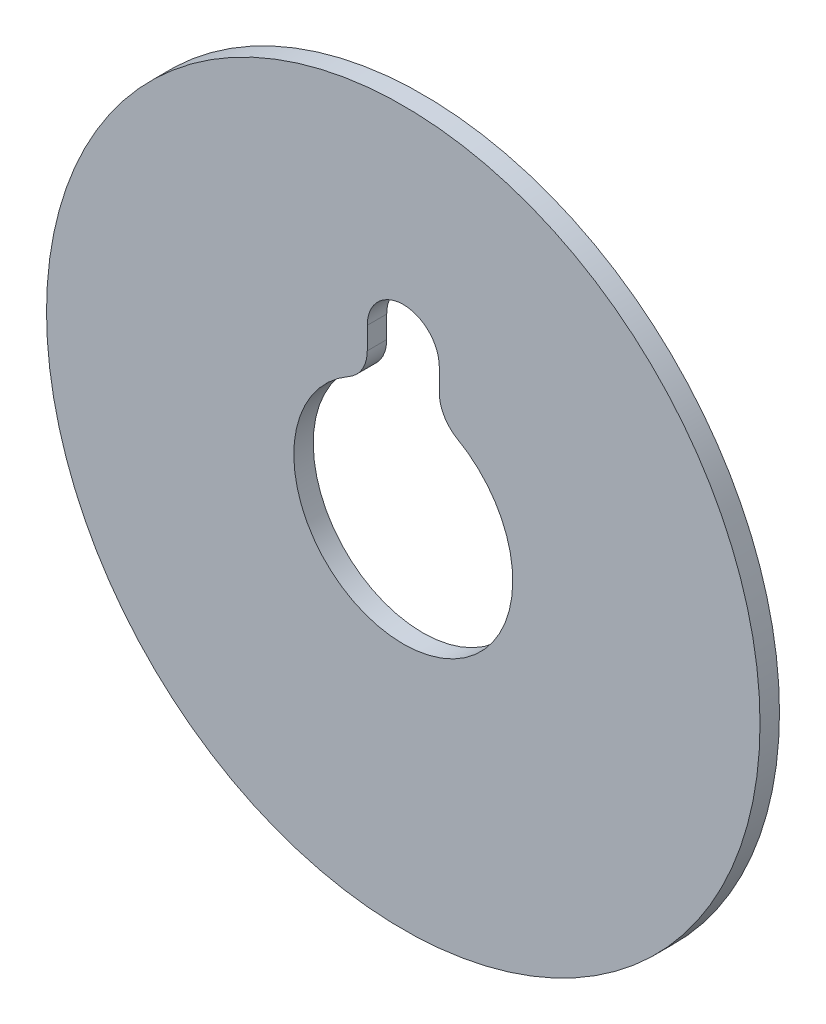
ISO-10303-21;
HEADER;
FILE_DESCRIPTION(('STEP AP214'),'2;1');
FILE_NAME('part.step','',(''),(''),'','','');
FILE_SCHEMA(('AUTOMOTIVE_DESIGN { 1 0 10303 214 1 1 1 1 }'));
ENDSEC;
DATA;
#1=APPLICATION_CONTEXT('core data for automotive mechanical design processes');
#2=APPLICATION_PROTOCOL_DEFINITION('international standard','automotive_design',2000,#1);
#3=PRODUCT_CONTEXT('',#1,'mechanical');
#4=PRODUCT('Part','Part','',(#3));
#5=PRODUCT_RELATED_PRODUCT_CATEGORY('part','',(#4));
#6=PRODUCT_DEFINITION_FORMATION('','',#4);
#7=PRODUCT_DEFINITION_CONTEXT('part definition',#1,'design');
#8=PRODUCT_DEFINITION('design','',#6,#7);
#9=PRODUCT_DEFINITION_SHAPE('','',#8);
#10=(LENGTH_UNIT() NAMED_UNIT(*) SI_UNIT(.MILLI.,.METRE.));
#11=(NAMED_UNIT(*) PLANE_ANGLE_UNIT() SI_UNIT($,.RADIAN.));
#12=(NAMED_UNIT(*) SI_UNIT($,.STERADIAN.) SOLID_ANGLE_UNIT());
#13=UNCERTAINTY_MEASURE_WITH_UNIT(LENGTH_MEASURE(1.E-05),#10,'distance_accuracy_value','');
#14=(GEOMETRIC_REPRESENTATION_CONTEXT(3) GLOBAL_UNCERTAINTY_ASSIGNED_CONTEXT((#13)) GLOBAL_UNIT_ASSIGNED_CONTEXT((#10,
#11,#12)) REPRESENTATION_CONTEXT('',''));
#15=CARTESIAN_POINT('',(0.,0.,0.));
#16=DIRECTION('',(0.,0.,1.));
#17=DIRECTION('',(1.,0.,0.));
#18=AXIS2_PLACEMENT_3D('',#15,#16,#17);
#19=CARTESIAN_POINT('',(0.,0.,3.429));
#20=DIRECTION('',(0.,0.,-1.));
#21=DIRECTION('',(-1.,0.,0.));
#22=AXIS2_PLACEMENT_3D('',#19,#20,#21);
#23=PLANE('',#22);
#24=DIRECTION('',(0.,1.,0.));
#25=VECTOR('',#24,1.);
#26=CARTESIAN_POINT('',(-6.35,22.2898567963109,3.429));
#27=LINE('',#26,#25);
#28=CARTESIAN_POINT('',(-6.35,22.2898567963104,3.429));
#29=VERTEX_POINT('',#28);
#30=CARTESIAN_POINT('',(-6.35,26.19248,3.429));
#31=VERTEX_POINT('',#30);
#32=EDGE_CURVE('E73',#29,#31,#27,.T.);
#33=ORIENTED_EDGE('',*,*,#32,.T.);
#34=CARTESIAN_POINT('',(0.,26.19248,3.429));
#35=DIRECTION('',(0.,0.,1.));
#36=DIRECTION('',(1.,0.,0.));
#37=AXIS2_PLACEMENT_3D('',#34,#35,#36);
#38=CIRCLE('',#37,6.35);
#39=CARTESIAN_POINT('',(6.35,26.19248,3.429));
#40=VERTEX_POINT('',#39);
#41=EDGE_CURVE('E109',#31,#40,#38,.F.);
#42=ORIENTED_EDGE('',*,*,#41,.T.);
#43=DIRECTION('',(0.,1.,0.));
#44=VECTOR('',#43,1.);
#45=CARTESIAN_POINT('',(6.35,26.19248,3.429));
#46=LINE('',#45,#44);
#47=CARTESIAN_POINT('',(6.35,22.2898567963104,3.429));
#48=VERTEX_POINT('',#47);
#49=EDGE_CURVE('E94',#40,#48,#46,.F.);
#50=ORIENTED_EDGE('',*,*,#49,.T.);
#51=CARTESIAN_POINT('',(12.7,22.2898567963098,3.429));
#52=DIRECTION('',(0.,0.,1.));
#53=DIRECTION('',(1.,0.,0.));
#54=AXIS2_PLACEMENT_3D('',#51,#52,#53);
#55=CIRCLE('',#54,6.35);
#56=CARTESIAN_POINT('',(9.5564356435642,16.7725655100946,3.429));
#57=VERTEX_POINT('',#56);
#58=EDGE_CURVE('E111',#57,#48,#55,.F.);
#59=ORIENTED_EDGE('',*,*,#58,.F.);
#60=CARTESIAN_POINT('',(0.,0.,3.429));
#61=DIRECTION('',(0.,0.,1.));
#62=DIRECTION('',(1.,0.,0.));
#63=AXIS2_PLACEMENT_3D('',#60,#61,#62);
#64=CIRCLE('',#63,19.304);
#65=CARTESIAN_POINT('',(-9.5564356435642,16.7725655100946,3.429));
#66=VERTEX_POINT('',#65);
#67=EDGE_CURVE('E75',#57,#66,#64,.F.);
#68=ORIENTED_EDGE('',*,*,#67,.T.);
#69=CARTESIAN_POINT('',(-12.7,22.2898567963098,3.429));
#70=DIRECTION('',(0.,0.,1.));
#71=DIRECTION('',(1.,0.,0.));
#72=AXIS2_PLACEMENT_3D('',#69,#70,#71);
#73=CIRCLE('',#72,6.35);
#74=EDGE_CURVE('E68',#29,#66,#73,.F.);
#75=ORIENTED_EDGE('',*,*,#74,.F.);
#76=EDGE_LOOP('',(#33,#42,#50,#59,#68,#75));
#77=FACE_BOUND('',#76,.T.);
#78=CARTESIAN_POINT('',(0.,0.,3.429));
#79=DIRECTION('',(0.,0.,1.));
#80=DIRECTION('',(1.,0.,0.));
#81=AXIS2_PLACEMENT_3D('',#78,#79,#80);
#82=CIRCLE('',#81,62.90437);
#83=CARTESIAN_POINT('',(62.90437,0.,3.429));
#84=VERTEX_POINT('',#83);
#85=EDGE_CURVE('E20',#84,#84,#82,.F.);
#86=ORIENTED_EDGE('',*,*,#85,.F.);
#87=EDGE_LOOP('',(#86));
#88=FACE_BOUND('',#87,.T.);
#89=ADVANCED_FACE('F17',(#77,#88),#23,.F.);
#90=CARTESIAN_POINT('',(0.,0.,0.));
#91=DIRECTION('',(0.,0.,1.));
#92=DIRECTION('',(1.,0.,0.));
#93=AXIS2_PLACEMENT_3D('',#90,#91,#92);
#94=CYLINDRICAL_SURFACE('',#93,62.90437);
#95=CARTESIAN_POINT('',(0.,0.,0.));
#96=DIRECTION('',(0.,0.,1.));
#97=DIRECTION('',(1.,0.,0.));
#98=AXIS2_PLACEMENT_3D('',#95,#96,#97);
#99=CIRCLE('',#98,62.90437);
#100=CARTESIAN_POINT('',(62.90437,0.,0.));
#101=VERTEX_POINT('',#100);
#102=EDGE_CURVE('E87',#101,#101,#99,.F.);
#103=ORIENTED_EDGE('',*,*,#102,.F.);
#104=EDGE_LOOP('',(#103));
#105=FACE_BOUND('',#104,.T.);
#106=ORIENTED_EDGE('',*,*,#85,.T.);
#107=EDGE_LOOP('',(#106));
#108=FACE_BOUND('',#107,.T.);
#109=ADVANCED_FACE('F188',(#105,#108),#94,.T.);
#110=CARTESIAN_POINT('',(-12.7,22.2898567963098,0.));
#111=DIRECTION('',(0.,0.,1.));
#112=DIRECTION('',(1.,0.,0.));
#113=AXIS2_PLACEMENT_3D('',#110,#111,#112);
#114=CYLINDRICAL_SURFACE('',#113,6.35);
#115=CARTESIAN_POINT('',(-12.7,22.2898567963098,0.));
#116=DIRECTION('',(0.,0.,1.));
#117=DIRECTION('',(1.,0.,0.));
#118=AXIS2_PLACEMENT_3D('',#115,#116,#117);
#119=CIRCLE('',#118,6.35);
#120=CARTESIAN_POINT('',(-6.35,22.2898567963104,0.));
#121=VERTEX_POINT('',#120);
#122=CARTESIAN_POINT('',(-9.5564356435642,16.7725655100946,0.));
#123=VERTEX_POINT('',#122);
#124=EDGE_CURVE('E83',#121,#123,#119,.F.);
#125=ORIENTED_EDGE('',*,*,#124,.F.);
#126=DIRECTION('',(0.,0.,1.));
#127=VECTOR('',#126,1.);
#128=CARTESIAN_POINT('',(-6.35,22.2898567963109,0.));
#129=LINE('',#128,#127);
#130=EDGE_CURVE('E80',#121,#29,#129,.T.);
#131=ORIENTED_EDGE('',*,*,#130,.T.);
#132=ORIENTED_EDGE('',*,*,#74,.T.);
#133=DIRECTION('',(0.,0.,1.));
#134=VECTOR('',#133,1.);
#135=CARTESIAN_POINT('',(-9.55643564356404,16.7725655100947,0.));
#136=LINE('',#135,#134);
#137=EDGE_CURVE('E78',#66,#123,#136,.F.);
#138=ORIENTED_EDGE('',*,*,#137,.T.);
#139=EDGE_LOOP('',(#125,#131,#132,#138));
#140=FACE_BOUND('',#139,.T.);
#141=ADVANCED_FACE('F81',(#140),#114,.T.);
#142=CARTESIAN_POINT('',(0.,0.,0.));
#143=DIRECTION('',(0.,0.,1.));
#144=DIRECTION('',(1.,0.,0.));
#145=AXIS2_PLACEMENT_3D('',#142,#143,#144);
#146=CYLINDRICAL_SURFACE('',#145,19.304);
#147=DIRECTION('',(0.,0.,1.));
#148=VECTOR('',#147,1.);
#149=CARTESIAN_POINT('',(9.55643564356405,16.7725655100947,0.));
#150=LINE('',#149,#148);
#151=CARTESIAN_POINT('',(9.5564356435642,16.7725655100946,0.));
#152=VERTEX_POINT('',#151);
#153=EDGE_CURVE('E113',#152,#57,#150,.T.);
#154=ORIENTED_EDGE('',*,*,#153,.F.);
#155=CARTESIAN_POINT('',(0.,0.,0.));
#156=DIRECTION('',(0.,0.,1.));
#157=DIRECTION('',(1.,0.,0.));
#158=AXIS2_PLACEMENT_3D('',#155,#156,#157);
#159=CIRCLE('',#158,19.304);
#160=EDGE_CURVE('E105',#123,#152,#159,.T.);
#161=ORIENTED_EDGE('',*,*,#160,.F.);
#162=ORIENTED_EDGE('',*,*,#137,.F.);
#163=ORIENTED_EDGE('',*,*,#67,.F.);
#164=EDGE_LOOP('',(#154,#161,#162,#163));
#165=FACE_BOUND('',#164,.T.);
#166=ADVANCED_FACE('F116',(#165),#146,.F.);
#167=CARTESIAN_POINT('',(12.7,22.2898567963098,0.));
#168=DIRECTION('',(0.,0.,1.));
#169=DIRECTION('',(1.,0.,0.));
#170=AXIS2_PLACEMENT_3D('',#167,#168,#169);
#171=CYLINDRICAL_SURFACE('',#170,6.35);
#172=CARTESIAN_POINT('',(12.7,22.2898567963098,0.));
#173=DIRECTION('',(0.,0.,1.));
#174=DIRECTION('',(1.,0.,0.));
#175=AXIS2_PLACEMENT_3D('',#172,#173,#174);
#176=CIRCLE('',#175,6.35);
#177=CARTESIAN_POINT('',(6.35,22.2898567963104,0.));
#178=VERTEX_POINT('',#177);
#179=EDGE_CURVE('E102',#152,#178,#176,.F.);
#180=ORIENTED_EDGE('',*,*,#179,.F.);
#181=ORIENTED_EDGE('',*,*,#153,.T.);
#182=ORIENTED_EDGE('',*,*,#58,.T.);
#183=DIRECTION('',(0.,0.,-1.));
#184=VECTOR('',#183,1.);
#185=CARTESIAN_POINT('',(6.35,22.2898567963109,0.));
#186=LINE('',#185,#184);
#187=EDGE_CURVE('E98',#48,#178,#186,.T.);
#188=ORIENTED_EDGE('',*,*,#187,.T.);
#189=EDGE_LOOP('',(#180,#181,#182,#188));
#190=FACE_BOUND('',#189,.T.);
#191=ADVANCED_FACE('F131',(#190),#171,.T.);
#192=CARTESIAN_POINT('',(6.35,26.19248,0.));
#193=DIRECTION('',(1.,0.,0.));
#194=DIRECTION('',(0.,0.,-1.));
#195=AXIS2_PLACEMENT_3D('',#192,#193,#194);
#196=PLANE('',#195);
#197=DIRECTION('',(0.,0.,1.));
#198=VECTOR('',#197,1.);
#199=CARTESIAN_POINT('',(6.35,26.19248,0.));
#200=LINE('',#199,#198);
#201=CARTESIAN_POINT('',(6.35,26.19248,0.));
#202=VERTEX_POINT('',#201);
#203=EDGE_CURVE('E97',#40,#202,#200,.F.);
#204=ORIENTED_EDGE('',*,*,#203,.T.);
#205=DIRECTION('',(0.,1.,0.));
#206=VECTOR('',#205,1.);
#207=CARTESIAN_POINT('',(6.35,0.,0.));
#208=LINE('',#207,#206);
#209=EDGE_CURVE('E101',#178,#202,#208,.T.);
#210=ORIENTED_EDGE('',*,*,#209,.F.);
#211=ORIENTED_EDGE('',*,*,#187,.F.);
#212=ORIENTED_EDGE('',*,*,#49,.F.);
#213=EDGE_LOOP('',(#204,#210,#211,#212));
#214=FACE_BOUND('',#213,.T.);
#215=ADVANCED_FACE('F133',(#214),#196,.F.);
#216=CARTESIAN_POINT('',(0.,26.19248,0.));
#217=DIRECTION('',(0.,0.,1.));
#218=DIRECTION('',(1.,0.,0.));
#219=AXIS2_PLACEMENT_3D('',#216,#217,#218);
#220=CYLINDRICAL_SURFACE('',#219,6.35);
#221=DIRECTION('',(0.,0.,1.));
#222=VECTOR('',#221,1.);
#223=CARTESIAN_POINT('',(-6.35,26.19248,0.));
#224=LINE('',#223,#222);
#225=CARTESIAN_POINT('',(-6.35,26.19248,0.));
#226=VERTEX_POINT('',#225);
#227=EDGE_CURVE('E35',#31,#226,#224,.F.);
#228=ORIENTED_EDGE('',*,*,#227,.T.);
#229=CARTESIAN_POINT('',(0.,26.19248,0.));
#230=DIRECTION('',(0.,0.,1.));
#231=DIRECTION('',(1.,0.,0.));
#232=AXIS2_PLACEMENT_3D('',#229,#230,#231);
#233=CIRCLE('',#232,6.35);
#234=EDGE_CURVE('E26',#202,#226,#233,.T.);
#235=ORIENTED_EDGE('',*,*,#234,.F.);
#236=ORIENTED_EDGE('',*,*,#203,.F.);
#237=ORIENTED_EDGE('',*,*,#41,.F.);
#238=EDGE_LOOP('',(#228,#235,#236,#237));
#239=FACE_BOUND('',#238,.T.);
#240=ADVANCED_FACE('F125',(#239),#220,.F.);
#241=CARTESIAN_POINT('',(-6.35,22.2898567963109,0.));
#242=DIRECTION('',(-1.,0.,0.));
#243=DIRECTION('',(0.,0.,1.));
#244=AXIS2_PLACEMENT_3D('',#241,#242,#243);
#245=PLANE('',#244);
#246=ORIENTED_EDGE('',*,*,#130,.F.);
#247=DIRECTION('',(0.,1.,0.));
#248=VECTOR('',#247,1.);
#249=CARTESIAN_POINT('',(-6.35,0.,0.));
#250=LINE('',#249,#248);
#251=EDGE_CURVE('E11',#226,#121,#250,.F.);
#252=ORIENTED_EDGE('',*,*,#251,.F.);
#253=ORIENTED_EDGE('',*,*,#227,.F.);
#254=ORIENTED_EDGE('',*,*,#32,.F.);
#255=EDGE_LOOP('',(#246,#252,#253,#254));
#256=FACE_BOUND('',#255,.T.);
#257=ADVANCED_FACE('F86',(#256),#245,.F.);
#258=CARTESIAN_POINT('',(0.,0.,0.));
#259=DIRECTION('',(0.,0.,-1.));
#260=DIRECTION('',(-1.,0.,0.));
#261=AXIS2_PLACEMENT_3D('',#258,#259,#260);
#262=PLANE('',#261);
#263=ORIENTED_EDGE('',*,*,#234,.T.);
#264=ORIENTED_EDGE('',*,*,#251,.T.);
#265=ORIENTED_EDGE('',*,*,#124,.T.);
#266=ORIENTED_EDGE('',*,*,#160,.T.);
#267=ORIENTED_EDGE('',*,*,#179,.T.);
#268=ORIENTED_EDGE('',*,*,#209,.T.);
#269=EDGE_LOOP('',(#263,#264,#265,#266,#267,#268));
#270=FACE_BOUND('',#269,.T.);
#271=ORIENTED_EDGE('',*,*,#102,.T.);
#272=EDGE_LOOP('',(#271));
#273=FACE_BOUND('',#272,.T.);
#274=ADVANCED_FACE('F120',(#270,#273),#262,.T.);
#275=CLOSED_SHELL('',(#89,#109,#141,#166,#191,#215,#240,#257,#274));
#276=MANIFOLD_SOLID_BREP('B1',#275);
#277=ADVANCED_BREP_SHAPE_REPRESENTATION('',(#18,#276),#14);
#278=SHAPE_DEFINITION_REPRESENTATION(#9,#277);
ENDSEC;
END-ISO-10303-21;
